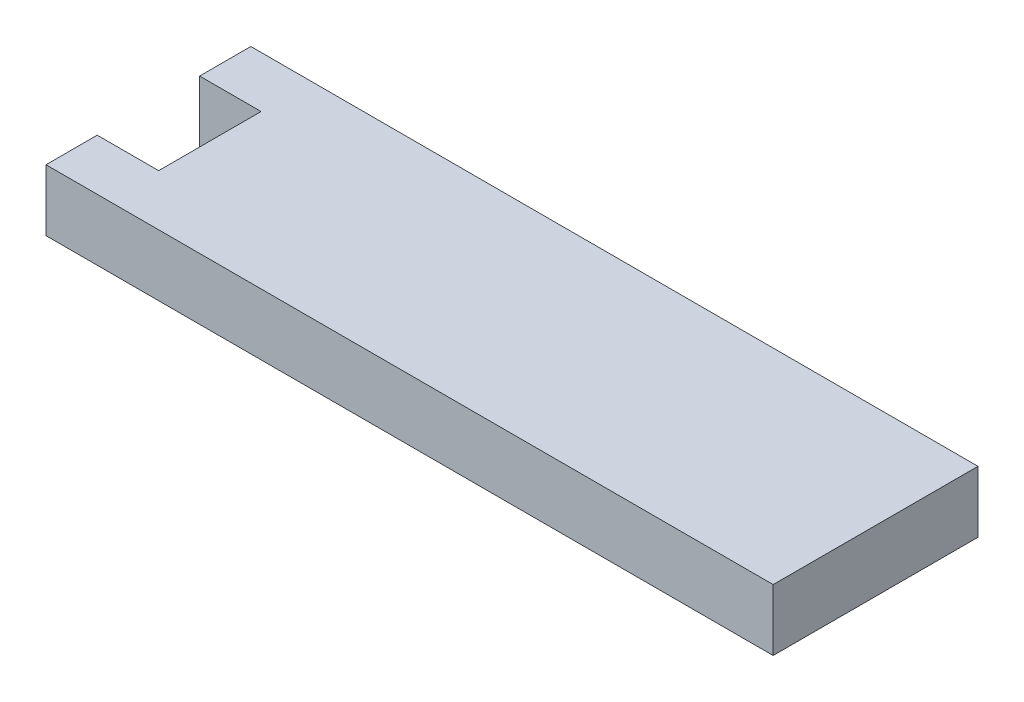
ISO-10303-21;
HEADER;
FILE_DESCRIPTION(('STEP AP214'),'2;1');
FILE_NAME('part.step','',(''),(''),'','','');
FILE_SCHEMA(('AUTOMOTIVE_DESIGN { 1 0 10303 214 1 1 1 1 }'));
ENDSEC;
DATA;
#1=APPLICATION_CONTEXT('core data for automotive mechanical design processes');
#2=APPLICATION_PROTOCOL_DEFINITION('international standard','automotive_design',2000,#1);
#3=PRODUCT_CONTEXT('',#1,'mechanical');
#4=PRODUCT('Part','Part','',(#3));
#5=PRODUCT_RELATED_PRODUCT_CATEGORY('part','',(#4));
#6=PRODUCT_DEFINITION_FORMATION('','',#4);
#7=PRODUCT_DEFINITION_CONTEXT('part definition',#1,'design');
#8=PRODUCT_DEFINITION('design','',#6,#7);
#9=PRODUCT_DEFINITION_SHAPE('','',#8);
#10=(LENGTH_UNIT() NAMED_UNIT(*) SI_UNIT(.MILLI.,.METRE.));
#11=(NAMED_UNIT(*) PLANE_ANGLE_UNIT() SI_UNIT($,.RADIAN.));
#12=(NAMED_UNIT(*) SI_UNIT($,.STERADIAN.) SOLID_ANGLE_UNIT());
#13=UNCERTAINTY_MEASURE_WITH_UNIT(LENGTH_MEASURE(1.E-05),#10,'distance_accuracy_value','');
#14=(GEOMETRIC_REPRESENTATION_CONTEXT(3) GLOBAL_UNCERTAINTY_ASSIGNED_CONTEXT((#13)) GLOBAL_UNIT_ASSIGNED_CONTEXT((#10,
#11,#12)) REPRESENTATION_CONTEXT('',''));
#15=CARTESIAN_POINT('',(0.,0.,0.));
#16=DIRECTION('',(0.,0.,1.));
#17=DIRECTION('',(1.,0.,0.));
#18=AXIS2_PLACEMENT_3D('',#15,#16,#17);
#19=CARTESIAN_POINT('',(-35.5,6.00000000000001,-10.));
#20=DIRECTION('',(1.,0.,0.));
#21=DIRECTION('',(0.,0.,-1.));
#22=AXIS2_PLACEMENT_3D('',#19,#20,#21);
#23=PLANE('',#22);
#24=DIRECTION('',(0.,0.,1.));
#25=VECTOR('',#24,1.);
#26=CARTESIAN_POINT('',(-35.5,6.00000000000001,-10.));
#27=LINE('',#26,#25);
#28=CARTESIAN_POINT('',(-35.5,6.00000000000001,5.));
#29=VERTEX_POINT('',#28);
#30=CARTESIAN_POINT('',(-35.5,6.00000000000001,10.));
#31=VERTEX_POINT('',#30);
#32=EDGE_CURVE('E137',#29,#31,#27,.T.);
#33=ORIENTED_EDGE('',*,*,#32,.F.);
#34=DIRECTION('',(0.,-1.,0.));
#35=VECTOR('',#34,1.);
#36=CARTESIAN_POINT('',(-35.5,6.00000000000001,5.));
#37=LINE('',#36,#35);
#38=CARTESIAN_POINT('',(-35.5,0.,5.));
#39=VERTEX_POINT('',#38);
#40=EDGE_CURVE('E151',#29,#39,#37,.T.);
#41=ORIENTED_EDGE('',*,*,#40,.T.);
#42=DIRECTION('',(0.,0.,1.));
#43=VECTOR('',#42,1.);
#44=CARTESIAN_POINT('',(-35.5,0.,-10.));
#45=LINE('',#44,#43);
#46=CARTESIAN_POINT('',(-35.5,0.,10.));
#47=VERTEX_POINT('',#46);
#48=EDGE_CURVE('E159',#39,#47,#45,.T.);
#49=ORIENTED_EDGE('',*,*,#48,.T.);
#50=DIRECTION('',(0.,-1.,0.));
#51=VECTOR('',#50,1.);
#52=CARTESIAN_POINT('',(-35.5,6.00000000000001,10.));
#53=LINE('',#52,#51);
#54=EDGE_CURVE('E53',#31,#47,#53,.T.);
#55=ORIENTED_EDGE('',*,*,#54,.F.);
#56=EDGE_LOOP('',(#33,#41,#49,#55));
#57=FACE_BOUND('',#56,.T.);
#58=ADVANCED_FACE('F43',(#57),#23,.F.);
#59=CARTESIAN_POINT('',(-35.5,6.00000000000001,-10.));
#60=DIRECTION('',(0.,0.,-1.));
#61=DIRECTION('',(-1.,0.,0.));
#62=AXIS2_PLACEMENT_3D('',#59,#60,#61);
#63=PLANE('',#62);
#64=DIRECTION('',(1.,0.,0.));
#65=VECTOR('',#64,1.);
#66=CARTESIAN_POINT('',(-35.5,0.,-10.));
#67=LINE('',#66,#65);
#68=CARTESIAN_POINT('',(-35.5,0.,-10.));
#69=VERTEX_POINT('',#68);
#70=CARTESIAN_POINT('',(35.5,0.,-10.));
#71=VERTEX_POINT('',#70);
#72=EDGE_CURVE('E146',#69,#71,#67,.T.);
#73=ORIENTED_EDGE('',*,*,#72,.F.);
#74=DIRECTION('',(0.,-1.,0.));
#75=VECTOR('',#74,1.);
#76=CARTESIAN_POINT('',(-35.5,6.00000000000001,-10.));
#77=LINE('',#76,#75);
#78=CARTESIAN_POINT('',(-35.5,6.00000000000001,-10.));
#79=VERTEX_POINT('',#78);
#80=EDGE_CURVE('E11',#79,#69,#77,.T.);
#81=ORIENTED_EDGE('',*,*,#80,.F.);
#82=DIRECTION('',(1.,0.,0.));
#83=VECTOR('',#82,1.);
#84=CARTESIAN_POINT('',(-35.5,6.00000000000001,-10.));
#85=LINE('',#84,#83);
#86=CARTESIAN_POINT('',(35.5,6.00000000000001,-10.));
#87=VERTEX_POINT('',#86);
#88=EDGE_CURVE('E135',#79,#87,#85,.T.);
#89=ORIENTED_EDGE('',*,*,#88,.T.);
#90=DIRECTION('',(0.,-1.,0.));
#91=VECTOR('',#90,1.);
#92=CARTESIAN_POINT('',(35.5,6.00000000000001,-10.));
#93=LINE('',#92,#91);
#94=EDGE_CURVE('E47',#87,#71,#93,.T.);
#95=ORIENTED_EDGE('',*,*,#94,.T.);
#96=EDGE_LOOP('',(#73,#81,#89,#95));
#97=FACE_BOUND('',#96,.T.);
#98=ADVANCED_FACE('F45',(#97),#63,.T.);
#99=CARTESIAN_POINT('',(-35.5,0.,-5.));
#100=VERTEX_POINT('',#99);
#101=EDGE_CURVE('E130',#69,#100,#45,.T.);
#102=ORIENTED_EDGE('',*,*,#101,.T.);
#103=DIRECTION('',(0.,-1.,0.));
#104=VECTOR('',#103,1.);
#105=CARTESIAN_POINT('',(-35.5,6.00000000000001,-5.));
#106=LINE('',#105,#104);
#107=CARTESIAN_POINT('',(-35.5,6.00000000000001,-5.));
#108=VERTEX_POINT('',#107);
#109=EDGE_CURVE('E61',#108,#100,#106,.T.);
#110=ORIENTED_EDGE('',*,*,#109,.F.);
#111=EDGE_CURVE('E128',#79,#108,#27,.T.);
#112=ORIENTED_EDGE('',*,*,#111,.F.);
#113=ORIENTED_EDGE('',*,*,#80,.T.);
#114=EDGE_LOOP('',(#102,#110,#112,#113));
#115=FACE_BOUND('',#114,.T.);
#116=ADVANCED_FACE('F127',(#115),#23,.F.);
#117=CARTESIAN_POINT('',(-35.5,6.00000000000001,10.));
#118=DIRECTION('',(0.,0.,-1.));
#119=DIRECTION('',(-1.,0.,0.));
#120=AXIS2_PLACEMENT_3D('',#117,#118,#119);
#121=PLANE('',#120);
#122=DIRECTION('',(1.,0.,0.));
#123=VECTOR('',#122,1.);
#124=CARTESIAN_POINT('',(-35.5,0.,10.));
#125=LINE('',#124,#123);
#126=CARTESIAN_POINT('',(35.5,0.,10.));
#127=VERTEX_POINT('',#126);
#128=EDGE_CURVE('E155',#47,#127,#125,.T.);
#129=ORIENTED_EDGE('',*,*,#128,.T.);
#130=DIRECTION('',(0.,-1.,0.));
#131=VECTOR('',#130,1.);
#132=CARTESIAN_POINT('',(35.5,6.00000000000001,10.));
#133=LINE('',#132,#131);
#134=CARTESIAN_POINT('',(35.5,6.00000000000001,10.));
#135=VERTEX_POINT('',#134);
#136=EDGE_CURVE('E141',#135,#127,#133,.T.);
#137=ORIENTED_EDGE('',*,*,#136,.F.);
#138=DIRECTION('',(1.,0.,0.));
#139=VECTOR('',#138,1.);
#140=CARTESIAN_POINT('',(-35.5,6.00000000000001,10.));
#141=LINE('',#140,#139);
#142=EDGE_CURVE('E142',#31,#135,#141,.T.);
#143=ORIENTED_EDGE('',*,*,#142,.F.);
#144=ORIENTED_EDGE('',*,*,#54,.T.);
#145=EDGE_LOOP('',(#129,#137,#143,#144));
#146=FACE_BOUND('',#145,.T.);
#147=ADVANCED_FACE('F171',(#146),#121,.F.);
#148=CARTESIAN_POINT('',(35.5,6.00000000000001,-10.));
#149=DIRECTION('',(1.,0.,0.));
#150=DIRECTION('',(0.,0.,-1.));
#151=AXIS2_PLACEMENT_3D('',#148,#149,#150);
#152=PLANE('',#151);
#153=DIRECTION('',(0.,0.,1.));
#154=VECTOR('',#153,1.);
#155=CARTESIAN_POINT('',(35.5,0.,-10.));
#156=LINE('',#155,#154);
#157=EDGE_CURVE('E150',#71,#127,#156,.T.);
#158=ORIENTED_EDGE('',*,*,#157,.F.);
#159=ORIENTED_EDGE('',*,*,#94,.F.);
#160=DIRECTION('',(0.,0.,1.));
#161=VECTOR('',#160,1.);
#162=CARTESIAN_POINT('',(35.5,6.00000000000001,-10.));
#163=LINE('',#162,#161);
#164=EDGE_CURVE('E167',#87,#135,#163,.T.);
#165=ORIENTED_EDGE('',*,*,#164,.T.);
#166=ORIENTED_EDGE('',*,*,#136,.T.);
#167=EDGE_LOOP('',(#158,#159,#165,#166));
#168=FACE_BOUND('',#167,.T.);
#169=ADVANCED_FACE('F166',(#168),#152,.T.);
#170=CARTESIAN_POINT('',(0.,6.00000000000001,0.));
#171=DIRECTION('',(0.,-1.,0.));
#172=DIRECTION('',(0.,0.,-1.));
#173=AXIS2_PLACEMENT_3D('',#170,#171,#172);
#174=PLANE('',#173);
#175=DIRECTION('',(0.,0.,1.));
#176=VECTOR('',#175,1.);
#177=CARTESIAN_POINT('',(-29.5,6.00000000000001,0.));
#178=LINE('',#177,#176);
#179=CARTESIAN_POINT('',(-29.5,6.00000000000001,-5.));
#180=VERTEX_POINT('',#179);
#181=CARTESIAN_POINT('',(-29.5,6.00000000000001,5.));
#182=VERTEX_POINT('',#181);
#183=EDGE_CURVE('E124',#180,#182,#178,.T.);
#184=ORIENTED_EDGE('',*,*,#183,.T.);
#185=DIRECTION('',(-1.,0.,0.));
#186=VECTOR('',#185,1.);
#187=CARTESIAN_POINT('',(-35.5,6.00000000000001,5.));
#188=LINE('',#187,#186);
#189=EDGE_CURVE('E132',#182,#29,#188,.T.);
#190=ORIENTED_EDGE('',*,*,#189,.T.);
#191=ORIENTED_EDGE('',*,*,#32,.T.);
#192=ORIENTED_EDGE('',*,*,#142,.T.);
#193=ORIENTED_EDGE('',*,*,#164,.F.);
#194=ORIENTED_EDGE('',*,*,#88,.F.);
#195=ORIENTED_EDGE('',*,*,#111,.T.);
#196=DIRECTION('',(1.,0.,0.));
#197=VECTOR('',#196,1.);
#198=CARTESIAN_POINT('',(-35.5,6.00000000000001,-5.));
#199=LINE('',#198,#197);
#200=EDGE_CURVE('E116',#108,#180,#199,.T.);
#201=ORIENTED_EDGE('',*,*,#200,.T.);
#202=EDGE_LOOP('',(#184,#190,#191,#192,#193,#194,#195,#201));
#203=FACE_BOUND('',#202,.T.);
#204=ADVANCED_FACE('F134',(#203),#174,.F.);
#205=CARTESIAN_POINT('',(0.,0.,0.));
#206=DIRECTION('',(0.,-1.,0.));
#207=DIRECTION('',(0.,0.,-1.));
#208=AXIS2_PLACEMENT_3D('',#205,#206,#207);
#209=PLANE('',#208);
#210=DIRECTION('',(-1.,0.,0.));
#211=VECTOR('',#210,1.);
#212=CARTESIAN_POINT('',(-35.5,0.,5.));
#213=LINE('',#212,#211);
#214=CARTESIAN_POINT('',(-29.5,0.,5.));
#215=VERTEX_POINT('',#214);
#216=EDGE_CURVE('E125',#215,#39,#213,.T.);
#217=ORIENTED_EDGE('',*,*,#216,.F.);
#218=DIRECTION('',(0.,0.,1.));
#219=VECTOR('',#218,1.);
#220=CARTESIAN_POINT('',(-29.5,0.,5.));
#221=LINE('',#220,#219);
#222=CARTESIAN_POINT('',(-29.5,0.,-5.));
#223=VERTEX_POINT('',#222);
#224=EDGE_CURVE('E191',#223,#215,#221,.T.);
#225=ORIENTED_EDGE('',*,*,#224,.F.);
#226=DIRECTION('',(1.,0.,0.));
#227=VECTOR('',#226,1.);
#228=CARTESIAN_POINT('',(-35.5,0.,-5.));
#229=LINE('',#228,#227);
#230=EDGE_CURVE('E195',#100,#223,#229,.T.);
#231=ORIENTED_EDGE('',*,*,#230,.F.);
#232=ORIENTED_EDGE('',*,*,#101,.F.);
#233=ORIENTED_EDGE('',*,*,#72,.T.);
#234=ORIENTED_EDGE('',*,*,#157,.T.);
#235=ORIENTED_EDGE('',*,*,#128,.F.);
#236=ORIENTED_EDGE('',*,*,#48,.F.);
#237=EDGE_LOOP('',(#217,#225,#231,#232,#233,#234,#235,#236));
#238=FACE_BOUND('',#237,.T.);
#239=ADVANCED_FACE('F176',(#238),#209,.T.);
#240=CARTESIAN_POINT('',(-35.5,6.00000000000001,5.));
#241=DIRECTION('',(0.,0.,1.));
#242=DIRECTION('',(1.,0.,0.));
#243=AXIS2_PLACEMENT_3D('',#240,#241,#242);
#244=PLANE('',#243);
#245=ORIENTED_EDGE('',*,*,#216,.T.);
#246=ORIENTED_EDGE('',*,*,#40,.F.);
#247=ORIENTED_EDGE('',*,*,#189,.F.);
#248=DIRECTION('',(0.,-1.,0.));
#249=VECTOR('',#248,1.);
#250=CARTESIAN_POINT('',(-29.5,6.00000000000001,5.));
#251=LINE('',#250,#249);
#252=EDGE_CURVE('E183',#182,#215,#251,.T.);
#253=ORIENTED_EDGE('',*,*,#252,.T.);
#254=EDGE_LOOP('',(#245,#246,#247,#253));
#255=FACE_BOUND('',#254,.T.);
#256=ADVANCED_FACE('F208',(#255),#244,.F.);
#257=CARTESIAN_POINT('',(-29.5,6.00000000000001,5.));
#258=DIRECTION('',(1.,0.,0.));
#259=DIRECTION('',(0.,0.,-1.));
#260=AXIS2_PLACEMENT_3D('',#257,#258,#259);
#261=PLANE('',#260);
#262=ORIENTED_EDGE('',*,*,#224,.T.);
#263=ORIENTED_EDGE('',*,*,#252,.F.);
#264=ORIENTED_EDGE('',*,*,#183,.F.);
#265=DIRECTION('',(0.,-1.,0.));
#266=VECTOR('',#265,1.);
#267=CARTESIAN_POINT('',(-29.5,6.00000000000001,-5.));
#268=LINE('',#267,#266);
#269=EDGE_CURVE('E118',#180,#223,#268,.T.);
#270=ORIENTED_EDGE('',*,*,#269,.T.);
#271=EDGE_LOOP('',(#262,#263,#264,#270));
#272=FACE_BOUND('',#271,.T.);
#273=ADVANCED_FACE('F205',(#272),#261,.F.);
#274=CARTESIAN_POINT('',(-35.5,6.00000000000001,-5.));
#275=DIRECTION('',(0.,0.,-1.));
#276=DIRECTION('',(-1.,0.,0.));
#277=AXIS2_PLACEMENT_3D('',#274,#275,#276);
#278=PLANE('',#277);
#279=ORIENTED_EDGE('',*,*,#230,.T.);
#280=ORIENTED_EDGE('',*,*,#269,.F.);
#281=ORIENTED_EDGE('',*,*,#200,.F.);
#282=ORIENTED_EDGE('',*,*,#109,.T.);
#283=EDGE_LOOP('',(#279,#280,#281,#282));
#284=FACE_BOUND('',#283,.T.);
#285=ADVANCED_FACE('F117',(#284),#278,.F.);
#286=CLOSED_SHELL('',(#58,#98,#116,#147,#169,#204,#239,#256,#273,#285));
#287=MANIFOLD_SOLID_BREP('B2',#286);
#288=ADVANCED_BREP_SHAPE_REPRESENTATION('',(#18,#287),#14);
#289=SHAPE_DEFINITION_REPRESENTATION(#9,#288);
ENDSEC;
END-ISO-10303-21;
